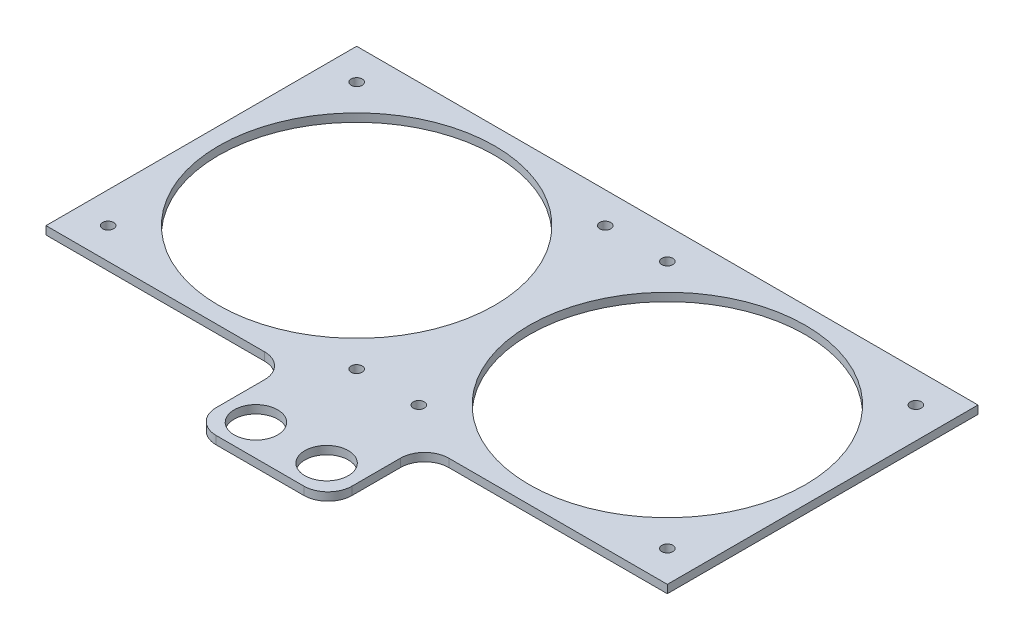
ISO-10303-21;
HEADER;
FILE_DESCRIPTION(('STEP AP214'),'2;1');
FILE_NAME('part.step','',(''),(''),'','','');
FILE_SCHEMA(('AUTOMOTIVE_DESIGN { 1 0 10303 214 1 1 1 1 }'));
ENDSEC;
DATA;
#1=APPLICATION_CONTEXT('core data for automotive mechanical design processes');
#2=APPLICATION_PROTOCOL_DEFINITION('international standard','automotive_design',2000,#1);
#3=PRODUCT_CONTEXT('',#1,'mechanical');
#4=PRODUCT('Part','Part','',(#3));
#5=PRODUCT_RELATED_PRODUCT_CATEGORY('part','',(#4));
#6=PRODUCT_DEFINITION_FORMATION('','',#4);
#7=PRODUCT_DEFINITION_CONTEXT('part definition',#1,'design');
#8=PRODUCT_DEFINITION('design','',#6,#7);
#9=PRODUCT_DEFINITION_SHAPE('','',#8);
#10=(LENGTH_UNIT() NAMED_UNIT(*) SI_UNIT(.MILLI.,.METRE.));
#11=(NAMED_UNIT(*) PLANE_ANGLE_UNIT() SI_UNIT($,.RADIAN.));
#12=(NAMED_UNIT(*) SI_UNIT($,.STERADIAN.) SOLID_ANGLE_UNIT());
#13=UNCERTAINTY_MEASURE_WITH_UNIT(LENGTH_MEASURE(1.E-05),#10,'distance_accuracy_value','');
#14=(GEOMETRIC_REPRESENTATION_CONTEXT(3) GLOBAL_UNCERTAINTY_ASSIGNED_CONTEXT((#13)) GLOBAL_UNIT_ASSIGNED_CONTEXT((#10,
#11,#12)) REPRESENTATION_CONTEXT('',''));
#15=CARTESIAN_POINT('',(0.,0.,0.));
#16=DIRECTION('',(0.,0.,1.));
#17=DIRECTION('',(1.,0.,0.));
#18=AXIS2_PLACEMENT_3D('',#15,#16,#17);
#19=CARTESIAN_POINT('',(0.,3.,0.));
#20=DIRECTION('',(0.,0.,-1.));
#21=DIRECTION('',(-1.,0.,0.));
#22=AXIS2_PLACEMENT_3D('',#19,#20,#21);
#23=PLANE('',#22);
#24=DIRECTION('',(1.,0.,0.));
#25=VECTOR('',#24,1.);
#26=CARTESIAN_POINT('',(0.,3.,0.));
#27=LINE('',#26,#25);
#28=CARTESIAN_POINT('',(148.19,3.,0.));
#29=VERTEX_POINT('',#28);
#30=CARTESIAN_POINT('',(228.6,3.,0.));
#31=VERTEX_POINT('',#30);
#32=EDGE_CURVE('E156',#29,#31,#27,.T.);
#33=ORIENTED_EDGE('',*,*,#32,.F.);
#34=DIRECTION('',(0.,1.,0.));
#35=VECTOR('',#34,1.);
#36=CARTESIAN_POINT('',(148.19,0.,0.));
#37=LINE('',#36,#35);
#38=CARTESIAN_POINT('',(148.19,0.,0.));
#39=VERTEX_POINT('',#38);
#40=EDGE_CURVE('E264',#29,#39,#37,.F.);
#41=ORIENTED_EDGE('',*,*,#40,.T.);
#42=DIRECTION('',(1.,0.,0.));
#43=VECTOR('',#42,1.);
#44=CARTESIAN_POINT('',(0.,0.,0.));
#45=LINE('',#44,#43);
#46=CARTESIAN_POINT('',(228.6,0.,0.));
#47=VERTEX_POINT('',#46);
#48=EDGE_CURVE('E219',#39,#47,#45,.T.);
#49=ORIENTED_EDGE('',*,*,#48,.T.);
#50=DIRECTION('',(0.,-1.,0.));
#51=VECTOR('',#50,1.);
#52=CARTESIAN_POINT('',(228.6,3.,0.));
#53=LINE('',#52,#51);
#54=EDGE_CURVE('E150',#31,#47,#53,.T.);
#55=ORIENTED_EDGE('',*,*,#54,.F.);
#56=EDGE_LOOP('',(#33,#41,#49,#55));
#57=FACE_BOUND('',#56,.T.);
#58=ADVANCED_FACE('F39',(#57),#23,.F.);
#59=CARTESIAN_POINT('',(0.,0.,0.));
#60=VERTEX_POINT('',#59);
#61=CARTESIAN_POINT('',(80.41,0.,0.));
#62=VERTEX_POINT('',#61);
#63=EDGE_CURVE('E220',#60,#62,#45,.T.);
#64=ORIENTED_EDGE('',*,*,#63,.T.);
#65=DIRECTION('',(0.,-1.,0.));
#66=VECTOR('',#65,1.);
#67=CARTESIAN_POINT('',(80.41,3.,0.));
#68=LINE('',#67,#66);
#69=CARTESIAN_POINT('',(80.41,3.,0.));
#70=VERTEX_POINT('',#69);
#71=EDGE_CURVE('E267',#62,#70,#68,.F.);
#72=ORIENTED_EDGE('',*,*,#71,.T.);
#73=CARTESIAN_POINT('',(0.,3.,0.));
#74=VERTEX_POINT('',#73);
#75=EDGE_CURVE('E139',#74,#70,#27,.T.);
#76=ORIENTED_EDGE('',*,*,#75,.F.);
#77=DIRECTION('',(0.,-1.,0.));
#78=VECTOR('',#77,1.);
#79=CARTESIAN_POINT('',(0.,3.,0.));
#80=LINE('',#79,#78);
#81=EDGE_CURVE('E227',#74,#60,#80,.T.);
#82=ORIENTED_EDGE('',*,*,#81,.T.);
#83=EDGE_LOOP('',(#64,#72,#76,#82));
#84=FACE_BOUND('',#83,.T.);
#85=ADVANCED_FACE('F365',(#84),#23,.F.);
#86=CARTESIAN_POINT('',(0.,3.,0.));
#87=DIRECTION('',(0.,-1.,0.));
#88=DIRECTION('',(0.,0.,-1.));
#89=AXIS2_PLACEMENT_3D('',#86,#87,#88);
#90=PLANE('',#89);
#91=CARTESIAN_POINT('',(101.3,3.,24.06));
#92=DIRECTION('',(0.,1.,0.));
#93=DIRECTION('',(0.,0.,1.));
#94=AXIS2_PLACEMENT_3D('',#91,#92,#93);
#95=CIRCLE('',#94,8.);
#96=CARTESIAN_POINT('',(101.3,3.,32.06));
#97=VERTEX_POINT('',#96);
#98=EDGE_CURVE('E418',#97,#97,#95,.T.);
#99=ORIENTED_EDGE('',*,*,#98,.F.);
#100=EDGE_LOOP('',(#99));
#101=FACE_BOUND('',#100,.T.);
#102=CARTESIAN_POINT('',(127.3,3.,24.06));
#103=DIRECTION('',(0.,1.,0.));
#104=DIRECTION('',(0.,0.,1.));
#105=AXIS2_PLACEMENT_3D('',#102,#103,#104);
#106=CIRCLE('',#105,8.00000000000001);
#107=CARTESIAN_POINT('',(127.3,3.,32.06));
#108=VERTEX_POINT('',#107);
#109=EDGE_CURVE('E410',#108,#108,#106,.T.);
#110=ORIENTED_EDGE('',*,*,#109,.F.);
#111=EDGE_LOOP('',(#110));
#112=FACE_BOUND('',#111,.T.);
#113=DIRECTION('',(-1.,0.,0.));
#114=VECTOR('',#113,1.);
#115=CARTESIAN_POINT('',(89.3,3.,35.56));
#116=LINE('',#115,#114);
#117=CARTESIAN_POINT('',(130.41,3.,35.56));
#118=VERTEX_POINT('',#117);
#119=CARTESIAN_POINT('',(98.19,3.,35.56));
#120=VERTEX_POINT('',#119);
#121=EDGE_CURVE('E405',#118,#120,#116,.T.);
#122=ORIENTED_EDGE('',*,*,#121,.F.);
#123=CARTESIAN_POINT('',(130.41,3.,26.67));
#124=DIRECTION('',(0.,-1.,0.));
#125=DIRECTION('',(0.,0.,-1.));
#126=AXIS2_PLACEMENT_3D('',#123,#124,#125);
#127=CIRCLE('',#126,8.89);
#128=CARTESIAN_POINT('',(139.3,3.,26.67));
#129=VERTEX_POINT('',#128);
#130=EDGE_CURVE('E242',#118,#129,#127,.F.);
#131=ORIENTED_EDGE('',*,*,#130,.T.);
#132=DIRECTION('',(0.,0.,-1.));
#133=VECTOR('',#132,1.);
#134=CARTESIAN_POINT('',(139.3,3.,35.56));
#135=LINE('',#134,#133);
#136=CARTESIAN_POINT('',(139.3,3.,8.89));
#137=VERTEX_POINT('',#136);
#138=EDGE_CURVE('E305',#129,#137,#135,.T.);
#139=ORIENTED_EDGE('',*,*,#138,.T.);
#140=CARTESIAN_POINT('',(148.19,3.,8.89));
#141=DIRECTION('',(0.,-1.,0.));
#142=DIRECTION('',(0.,0.,-1.));
#143=AXIS2_PLACEMENT_3D('',#140,#141,#142);
#144=CIRCLE('',#143,8.89);
#145=EDGE_CURVE('E270',#137,#29,#144,.T.);
#146=ORIENTED_EDGE('',*,*,#145,.T.);
#147=ORIENTED_EDGE('',*,*,#32,.T.);
#148=DIRECTION('',(0.,0.,1.));
#149=VECTOR('',#148,1.);
#150=CARTESIAN_POINT('',(228.6,3.,0.));
#151=LINE('',#150,#149);
#152=CARTESIAN_POINT('',(228.6,3.,-114.3));
#153=VERTEX_POINT('',#152);
#154=EDGE_CURVE('E145',#153,#31,#151,.T.);
#155=ORIENTED_EDGE('',*,*,#154,.F.);
#156=DIRECTION('',(-1.,0.,0.));
#157=VECTOR('',#156,1.);
#158=CARTESIAN_POINT('',(0.,3.,-114.3));
#159=LINE('',#158,#157);
#160=CARTESIAN_POINT('',(0.,3.,-114.3));
#161=VERTEX_POINT('',#160);
#162=EDGE_CURVE('E127',#153,#161,#159,.T.);
#163=ORIENTED_EDGE('',*,*,#162,.T.);
#164=DIRECTION('',(0.,0.,1.));
#165=VECTOR('',#164,1.);
#166=CARTESIAN_POINT('',(0.,3.,0.));
#167=LINE('',#166,#165);
#168=EDGE_CURVE('E209',#161,#74,#167,.T.);
#169=ORIENTED_EDGE('',*,*,#168,.T.);
#170=ORIENTED_EDGE('',*,*,#75,.T.);
#171=CARTESIAN_POINT('',(80.41,3.,8.89));
#172=DIRECTION('',(0.,-1.,0.));
#173=DIRECTION('',(0.,0.,-1.));
#174=AXIS2_PLACEMENT_3D('',#171,#172,#173);
#175=CIRCLE('',#174,8.89);
#176=CARTESIAN_POINT('',(89.3,3.,8.89));
#177=VERTEX_POINT('',#176);
#178=EDGE_CURVE('E11',#70,#177,#175,.T.);
#179=ORIENTED_EDGE('',*,*,#178,.T.);
#180=DIRECTION('',(0.,0.,-1.));
#181=VECTOR('',#180,1.);
#182=CARTESIAN_POINT('',(89.3,3.,35.56));
#183=LINE('',#182,#181);
#184=CARTESIAN_POINT('',(89.3,3.,26.67));
#185=VERTEX_POINT('',#184);
#186=EDGE_CURVE('E298',#185,#177,#183,.T.);
#187=ORIENTED_EDGE('',*,*,#186,.F.);
#188=CARTESIAN_POINT('',(98.19,3.,26.67));
#189=DIRECTION('',(0.,-1.,0.));
#190=DIRECTION('',(0.,0.,-1.));
#191=AXIS2_PLACEMENT_3D('',#188,#189,#190);
#192=CIRCLE('',#191,8.89);
#193=EDGE_CURVE('E239',#185,#120,#192,.F.);
#194=ORIENTED_EDGE('',*,*,#193,.T.);
#195=EDGE_LOOP('',(#122,#131,#139,#146,#147,#155,#163,#169,#170,#179,#187,#194));
#196=FACE_BOUND('',#195,.T.);
#197=CARTESIAN_POINT('',(57.15,3.,-57.15));
#198=DIRECTION('',(0.,1.,0.));
#199=DIRECTION('',(0.,0.,1.));
#200=AXIS2_PLACEMENT_3D('',#197,#198,#199);
#201=CIRCLE('',#200,50.8);
#202=CARTESIAN_POINT('',(57.15,3.,-6.35));
#203=VERTEX_POINT('',#202);
#204=EDGE_CURVE('E201',#203,#203,#201,.T.);
#205=ORIENTED_EDGE('',*,*,#204,.F.);
#206=EDGE_LOOP('',(#205));
#207=FACE_BOUND('',#206,.T.);
#208=CARTESIAN_POINT('',(11.43,3.,-102.87));
#209=DIRECTION('',(0.,1.,0.));
#210=DIRECTION('',(0.,0.,1.));
#211=AXIS2_PLACEMENT_3D('',#208,#209,#210);
#212=CIRCLE('',#211,2.032);
#213=CARTESIAN_POINT('',(11.43,3.,-100.838));
#214=VERTEX_POINT('',#213);
#215=EDGE_CURVE('E193',#214,#214,#212,.T.);
#216=ORIENTED_EDGE('',*,*,#215,.F.);
#217=EDGE_LOOP('',(#216));
#218=FACE_BOUND('',#217,.T.);
#219=CARTESIAN_POINT('',(102.87,3.,-102.87));
#220=DIRECTION('',(0.,1.,0.));
#221=DIRECTION('',(0.,0.,1.));
#222=AXIS2_PLACEMENT_3D('',#219,#220,#221);
#223=CIRCLE('',#222,2.03200000000001);
#224=CARTESIAN_POINT('',(102.87,3.,-100.838));
#225=VERTEX_POINT('',#224);
#226=EDGE_CURVE('E185',#225,#225,#223,.T.);
#227=ORIENTED_EDGE('',*,*,#226,.F.);
#228=EDGE_LOOP('',(#227));
#229=FACE_BOUND('',#228,.T.);
#230=CARTESIAN_POINT('',(102.87,3.,-11.43));
#231=DIRECTION('',(0.,1.,0.));
#232=DIRECTION('',(0.,0.,1.));
#233=AXIS2_PLACEMENT_3D('',#230,#231,#232);
#234=CIRCLE('',#233,2.03200000000001);
#235=CARTESIAN_POINT('',(102.87,3.,-9.39799999999998));
#236=VERTEX_POINT('',#235);
#237=EDGE_CURVE('E177',#236,#236,#234,.T.);
#238=ORIENTED_EDGE('',*,*,#237,.F.);
#239=EDGE_LOOP('',(#238));
#240=FACE_BOUND('',#239,.T.);
#241=CARTESIAN_POINT('',(11.43,3.,-11.43));
#242=DIRECTION('',(0.,1.,0.));
#243=DIRECTION('',(0.,0.,1.));
#244=AXIS2_PLACEMENT_3D('',#241,#242,#243);
#245=CIRCLE('',#244,2.032);
#246=CARTESIAN_POINT('',(11.43,3.,-9.39799999999999));
#247=VERTEX_POINT('',#246);
#248=EDGE_CURVE('E169',#247,#247,#245,.T.);
#249=ORIENTED_EDGE('',*,*,#248,.F.);
#250=EDGE_LOOP('',(#249));
#251=FACE_BOUND('',#250,.T.);
#252=CARTESIAN_POINT('',(217.17,3.,-11.43));
#253=DIRECTION('',(0.,-1.,0.));
#254=DIRECTION('',(0.,0.,1.));
#255=AXIS2_PLACEMENT_3D('',#252,#253,#254);
#256=CIRCLE('',#255,2.032);
#257=CARTESIAN_POINT('',(217.17,3.,-9.39799999999999));
#258=VERTEX_POINT('',#257);
#259=EDGE_CURVE('E316',#258,#258,#256,.T.);
#260=ORIENTED_EDGE('',*,*,#259,.T.);
#261=EDGE_LOOP('',(#260));
#262=FACE_BOUND('',#261,.T.);
#263=CARTESIAN_POINT('',(125.73,3.,-11.43));
#264=DIRECTION('',(0.,-1.,0.));
#265=DIRECTION('',(0.,0.,1.));
#266=AXIS2_PLACEMENT_3D('',#263,#264,#265);
#267=CIRCLE('',#266,2.03200000000001);
#268=CARTESIAN_POINT('',(125.73,3.,-9.39799999999998));
#269=VERTEX_POINT('',#268);
#270=EDGE_CURVE('E324',#269,#269,#267,.T.);
#271=ORIENTED_EDGE('',*,*,#270,.T.);
#272=EDGE_LOOP('',(#271));
#273=FACE_BOUND('',#272,.T.);
#274=CARTESIAN_POINT('',(125.73,3.,-102.87));
#275=DIRECTION('',(0.,-1.,0.));
#276=DIRECTION('',(0.,0.,1.));
#277=AXIS2_PLACEMENT_3D('',#274,#275,#276);
#278=CIRCLE('',#277,2.03200000000001);
#279=CARTESIAN_POINT('',(125.73,3.,-100.838));
#280=VERTEX_POINT('',#279);
#281=EDGE_CURVE('E332',#280,#280,#278,.T.);
#282=ORIENTED_EDGE('',*,*,#281,.T.);
#283=EDGE_LOOP('',(#282));
#284=FACE_BOUND('',#283,.T.);
#285=CARTESIAN_POINT('',(217.17,3.,-102.87));
#286=DIRECTION('',(0.,-1.,0.));
#287=DIRECTION('',(0.,0.,1.));
#288=AXIS2_PLACEMENT_3D('',#285,#286,#287);
#289=CIRCLE('',#288,2.032);
#290=CARTESIAN_POINT('',(217.17,3.,-100.838));
#291=VERTEX_POINT('',#290);
#292=EDGE_CURVE('E340',#291,#291,#289,.T.);
#293=ORIENTED_EDGE('',*,*,#292,.T.);
#294=EDGE_LOOP('',(#293));
#295=FACE_BOUND('',#294,.T.);
#296=CARTESIAN_POINT('',(171.45,3.,-57.15));
#297=DIRECTION('',(0.,-1.,0.));
#298=DIRECTION('',(0.,0.,1.));
#299=AXIS2_PLACEMENT_3D('',#296,#297,#298);
#300=CIRCLE('',#299,50.8);
#301=CARTESIAN_POINT('',(171.45,3.,-6.35));
#302=VERTEX_POINT('',#301);
#303=EDGE_CURVE('E163',#302,#302,#300,.T.);
#304=ORIENTED_EDGE('',*,*,#303,.T.);
#305=EDGE_LOOP('',(#304));
#306=FACE_BOUND('',#305,.T.);
#307=ADVANCED_FACE('F153',(#101,#112,#196,#207,#218,#229,#240,#251,#262,#273,#284,#295,#306),
#90,.F.);
#308=CARTESIAN_POINT('',(0.,0.,0.));
#309=DIRECTION('',(0.,-1.,0.));
#310=DIRECTION('',(0.,0.,-1.));
#311=AXIS2_PLACEMENT_3D('',#308,#309,#310);
#312=PLANE('',#311);
#313=CARTESIAN_POINT('',(101.3,0.,24.06));
#314=DIRECTION('',(0.,1.,0.));
#315=DIRECTION('',(0.,0.,1.));
#316=AXIS2_PLACEMENT_3D('',#313,#314,#315);
#317=CIRCLE('',#316,8.);
#318=CARTESIAN_POINT('',(101.3,0.,32.06));
#319=VERTEX_POINT('',#318);
#320=EDGE_CURVE('E407',#319,#319,#317,.T.);
#321=ORIENTED_EDGE('',*,*,#320,.T.);
#322=EDGE_LOOP('',(#321));
#323=FACE_BOUND('',#322,.T.);
#324=CARTESIAN_POINT('',(127.3,0.,24.06));
#325=DIRECTION('',(0.,1.,0.));
#326=DIRECTION('',(0.,0.,1.));
#327=AXIS2_PLACEMENT_3D('',#324,#325,#326);
#328=CIRCLE('',#327,8.00000000000001);
#329=CARTESIAN_POINT('',(127.3,0.,32.06));
#330=VERTEX_POINT('',#329);
#331=EDGE_CURVE('E414',#330,#330,#328,.T.);
#332=ORIENTED_EDGE('',*,*,#331,.T.);
#333=EDGE_LOOP('',(#332));
#334=FACE_BOUND('',#333,.T.);
#335=CARTESIAN_POINT('',(102.87,0.,-11.43));
#336=DIRECTION('',(0.,1.,0.));
#337=DIRECTION('',(0.,0.,1.));
#338=AXIS2_PLACEMENT_3D('',#335,#336,#337);
#339=CIRCLE('',#338,2.03200000000001);
#340=CARTESIAN_POINT('',(102.87,0.,-9.39799999999998));
#341=VERTEX_POINT('',#340);
#342=EDGE_CURVE('E173',#341,#341,#339,.T.);
#343=ORIENTED_EDGE('',*,*,#342,.T.);
#344=EDGE_LOOP('',(#343));
#345=FACE_BOUND('',#344,.T.);
#346=CARTESIAN_POINT('',(11.43,0.,-102.87));
#347=DIRECTION('',(0.,1.,0.));
#348=DIRECTION('',(0.,0.,1.));
#349=AXIS2_PLACEMENT_3D('',#346,#347,#348);
#350=CIRCLE('',#349,2.032);
#351=CARTESIAN_POINT('',(11.43,0.,-100.838));
#352=VERTEX_POINT('',#351);
#353=EDGE_CURVE('E189',#352,#352,#350,.T.);
#354=ORIENTED_EDGE('',*,*,#353,.T.);
#355=EDGE_LOOP('',(#354));
#356=FACE_BOUND('',#355,.T.);
#357=DIRECTION('',(0.,0.,-1.));
#358=VECTOR('',#357,1.);
#359=CARTESIAN_POINT('',(139.3,0.,35.56));
#360=LINE('',#359,#358);
#361=CARTESIAN_POINT('',(139.3,0.,26.67));
#362=VERTEX_POINT('',#361);
#363=CARTESIAN_POINT('',(139.3,0.,8.89));
#364=VERTEX_POINT('',#363);
#365=EDGE_CURVE('E301',#362,#364,#360,.T.);
#366=ORIENTED_EDGE('',*,*,#365,.F.);
#367=CARTESIAN_POINT('',(130.41,0.,26.67));
#368=DIRECTION('',(0.,-1.,0.));
#369=DIRECTION('',(0.,0.,-1.));
#370=AXIS2_PLACEMENT_3D('',#367,#368,#369);
#371=CIRCLE('',#370,8.89);
#372=CARTESIAN_POINT('',(130.41,0.,35.56));
#373=VERTEX_POINT('',#372);
#374=EDGE_CURVE('E255',#362,#373,#371,.T.);
#375=ORIENTED_EDGE('',*,*,#374,.T.);
#376=DIRECTION('',(1.,0.,0.));
#377=VECTOR('',#376,1.);
#378=CARTESIAN_POINT('',(89.3,0.,35.56));
#379=LINE('',#378,#377);
#380=CARTESIAN_POINT('',(98.19,0.,35.56));
#381=VERTEX_POINT('',#380);
#382=EDGE_CURVE('E308',#381,#373,#379,.T.);
#383=ORIENTED_EDGE('',*,*,#382,.F.);
#384=CARTESIAN_POINT('',(98.19,0.,26.67));
#385=DIRECTION('',(0.,-1.,0.));
#386=DIRECTION('',(0.,0.,-1.));
#387=AXIS2_PLACEMENT_3D('',#384,#385,#386);
#388=CIRCLE('',#387,8.89);
#389=CARTESIAN_POINT('',(89.3,0.,26.67));
#390=VERTEX_POINT('',#389);
#391=EDGE_CURVE('E252',#381,#390,#388,.T.);
#392=ORIENTED_EDGE('',*,*,#391,.T.);
#393=DIRECTION('',(0.,0.,-1.));
#394=VECTOR('',#393,1.);
#395=CARTESIAN_POINT('',(89.3,0.,35.56));
#396=LINE('',#395,#394);
#397=CARTESIAN_POINT('',(89.3,0.,8.89));
#398=VERTEX_POINT('',#397);
#399=EDGE_CURVE('E296',#390,#398,#396,.T.);
#400=ORIENTED_EDGE('',*,*,#399,.T.);
#401=CARTESIAN_POINT('',(80.41,0.,8.89));
#402=DIRECTION('',(0.,-1.,0.));
#403=DIRECTION('',(0.,0.,-1.));
#404=AXIS2_PLACEMENT_3D('',#401,#402,#403);
#405=CIRCLE('',#404,8.89);
#406=EDGE_CURVE('E48',#398,#62,#405,.F.);
#407=ORIENTED_EDGE('',*,*,#406,.T.);
#408=ORIENTED_EDGE('',*,*,#63,.F.);
#409=DIRECTION('',(0.,0.,1.));
#410=VECTOR('',#409,1.);
#411=CARTESIAN_POINT('',(0.,0.,0.));
#412=LINE('',#411,#410);
#413=CARTESIAN_POINT('',(0.,0.,-114.3));
#414=VERTEX_POINT('',#413);
#415=EDGE_CURVE('E205',#414,#60,#412,.T.);
#416=ORIENTED_EDGE('',*,*,#415,.F.);
#417=DIRECTION('',(-1.,0.,0.));
#418=VECTOR('',#417,1.);
#419=CARTESIAN_POINT('',(0.,0.,-114.3));
#420=LINE('',#419,#418);
#421=CARTESIAN_POINT('',(228.6,0.,-114.3));
#422=VERTEX_POINT('',#421);
#423=EDGE_CURVE('E212',#422,#414,#420,.T.);
#424=ORIENTED_EDGE('',*,*,#423,.F.);
#425=DIRECTION('',(0.,0.,1.));
#426=VECTOR('',#425,1.);
#427=CARTESIAN_POINT('',(228.6,0.,0.));
#428=LINE('',#427,#426);
#429=EDGE_CURVE('E147',#422,#47,#428,.T.);
#430=ORIENTED_EDGE('',*,*,#429,.T.);
#431=ORIENTED_EDGE('',*,*,#48,.F.);
#432=CARTESIAN_POINT('',(148.19,0.,8.89));
#433=DIRECTION('',(0.,-1.,0.));
#434=DIRECTION('',(0.,0.,-1.));
#435=AXIS2_PLACEMENT_3D('',#432,#433,#434);
#436=CIRCLE('',#435,8.89);
#437=EDGE_CURVE('E273',#39,#364,#436,.F.);
#438=ORIENTED_EDGE('',*,*,#437,.T.);
#439=EDGE_LOOP('',(#366,#375,#383,#392,#400,#407,#408,#416,#424,#430,#431,#438));
#440=FACE_BOUND('',#439,.T.);
#441=CARTESIAN_POINT('',(57.15,0.,-57.15));
#442=DIRECTION('',(0.,1.,0.));
#443=DIRECTION('',(0.,0.,1.));
#444=AXIS2_PLACEMENT_3D('',#441,#442,#443);
#445=CIRCLE('',#444,50.8);
#446=CARTESIAN_POINT('',(57.15,0.,-6.35));
#447=VERTEX_POINT('',#446);
#448=EDGE_CURVE('E197',#447,#447,#445,.T.);
#449=ORIENTED_EDGE('',*,*,#448,.T.);
#450=EDGE_LOOP('',(#449));
#451=FACE_BOUND('',#450,.T.);
#452=CARTESIAN_POINT('',(102.87,0.,-102.87));
#453=DIRECTION('',(0.,1.,0.));
#454=DIRECTION('',(0.,0.,1.));
#455=AXIS2_PLACEMENT_3D('',#452,#453,#454);
#456=CIRCLE('',#455,2.03200000000001);
#457=CARTESIAN_POINT('',(102.87,0.,-100.838));
#458=VERTEX_POINT('',#457);
#459=EDGE_CURVE('E181',#458,#458,#456,.T.);
#460=ORIENTED_EDGE('',*,*,#459,.T.);
#461=EDGE_LOOP('',(#460));
#462=FACE_BOUND('',#461,.T.);
#463=CARTESIAN_POINT('',(11.43,0.,-11.43));
#464=DIRECTION('',(0.,1.,0.));
#465=DIRECTION('',(0.,0.,1.));
#466=AXIS2_PLACEMENT_3D('',#463,#464,#465);
#467=CIRCLE('',#466,2.032);
#468=CARTESIAN_POINT('',(11.43,0.,-9.39799999999999));
#469=VERTEX_POINT('',#468);
#470=EDGE_CURVE('E149',#469,#469,#467,.T.);
#471=ORIENTED_EDGE('',*,*,#470,.T.);
#472=EDGE_LOOP('',(#471));
#473=FACE_BOUND('',#472,.T.);
#474=CARTESIAN_POINT('',(217.17,0.,-11.43));
#475=DIRECTION('',(0.,-1.,0.));
#476=DIRECTION('',(0.,0.,1.));
#477=AXIS2_PLACEMENT_3D('',#474,#475,#476);
#478=CIRCLE('',#477,2.032);
#479=CARTESIAN_POINT('',(217.17,0.,-9.39799999999999));
#480=VERTEX_POINT('',#479);
#481=EDGE_CURVE('E315',#480,#480,#478,.T.);
#482=ORIENTED_EDGE('',*,*,#481,.F.);
#483=EDGE_LOOP('',(#482));
#484=FACE_BOUND('',#483,.T.);
#485=CARTESIAN_POINT('',(125.73,0.,-11.43));
#486=DIRECTION('',(0.,-1.,0.));
#487=DIRECTION('',(0.,0.,1.));
#488=AXIS2_PLACEMENT_3D('',#485,#486,#487);
#489=CIRCLE('',#488,2.03200000000001);
#490=CARTESIAN_POINT('',(125.73,0.,-9.39799999999998));
#491=VERTEX_POINT('',#490);
#492=EDGE_CURVE('E320',#491,#491,#489,.T.);
#493=ORIENTED_EDGE('',*,*,#492,.F.);
#494=EDGE_LOOP('',(#493));
#495=FACE_BOUND('',#494,.T.);
#496=CARTESIAN_POINT('',(125.73,0.,-102.87));
#497=DIRECTION('',(0.,-1.,0.));
#498=DIRECTION('',(0.,0.,1.));
#499=AXIS2_PLACEMENT_3D('',#496,#497,#498);
#500=CIRCLE('',#499,2.03200000000001);
#501=CARTESIAN_POINT('',(125.73,0.,-100.838));
#502=VERTEX_POINT('',#501);
#503=EDGE_CURVE('E328',#502,#502,#500,.T.);
#504=ORIENTED_EDGE('',*,*,#503,.F.);
#505=EDGE_LOOP('',(#504));
#506=FACE_BOUND('',#505,.T.);
#507=CARTESIAN_POINT('',(217.17,0.,-102.87));
#508=DIRECTION('',(0.,-1.,0.));
#509=DIRECTION('',(0.,0.,1.));
#510=AXIS2_PLACEMENT_3D('',#507,#508,#509);
#511=CIRCLE('',#510,2.032);
#512=CARTESIAN_POINT('',(217.17,0.,-100.838));
#513=VERTEX_POINT('',#512);
#514=EDGE_CURVE('E336',#513,#513,#511,.T.);
#515=ORIENTED_EDGE('',*,*,#514,.F.);
#516=EDGE_LOOP('',(#515));
#517=FACE_BOUND('',#516,.T.);
#518=CARTESIAN_POINT('',(171.45,0.,-57.15));
#519=DIRECTION('',(0.,-1.,0.));
#520=DIRECTION('',(0.,0.,1.));
#521=AXIS2_PLACEMENT_3D('',#518,#519,#520);
#522=CIRCLE('',#521,50.8);
#523=CARTESIAN_POINT('',(171.45,0.,-6.35));
#524=VERTEX_POINT('',#523);
#525=EDGE_CURVE('E166',#524,#524,#522,.T.);
#526=ORIENTED_EDGE('',*,*,#525,.F.);
#527=EDGE_LOOP('',(#526));
#528=FACE_BOUND('',#527,.T.);
#529=ADVANCED_FACE('F283',(#323,#334,#345,#356,#440,#451,#462,#473,#484,#495,#506,#517,#528),
#312,.T.);
#530=CARTESIAN_POINT('',(0.,3.,0.));
#531=DIRECTION('',(1.,0.,0.));
#532=DIRECTION('',(0.,0.,-1.));
#533=AXIS2_PLACEMENT_3D('',#530,#531,#532);
#534=PLANE('',#533);
#535=ORIENTED_EDGE('',*,*,#415,.T.);
#536=ORIENTED_EDGE('',*,*,#81,.F.);
#537=ORIENTED_EDGE('',*,*,#168,.F.);
#538=DIRECTION('',(0.,-1.,0.));
#539=VECTOR('',#538,1.);
#540=CARTESIAN_POINT('',(0.,3.,-114.3));
#541=LINE('',#540,#539);
#542=EDGE_CURVE('E133',#161,#414,#541,.T.);
#543=ORIENTED_EDGE('',*,*,#542,.T.);
#544=EDGE_LOOP('',(#535,#536,#537,#543));
#545=FACE_BOUND('',#544,.T.);
#546=ADVANCED_FACE('F287',(#545),#534,.F.);
#547=CARTESIAN_POINT('',(0.,3.,-114.3));
#548=DIRECTION('',(0.,0.,1.));
#549=DIRECTION('',(1.,0.,0.));
#550=AXIS2_PLACEMENT_3D('',#547,#548,#549);
#551=PLANE('',#550);
#552=ORIENTED_EDGE('',*,*,#423,.T.);
#553=ORIENTED_EDGE('',*,*,#542,.F.);
#554=ORIENTED_EDGE('',*,*,#162,.F.);
#555=DIRECTION('',(0.,-1.,0.));
#556=VECTOR('',#555,1.);
#557=CARTESIAN_POINT('',(228.6,3.,-114.3));
#558=LINE('',#557,#556);
#559=EDGE_CURVE('E130',#153,#422,#558,.T.);
#560=ORIENTED_EDGE('',*,*,#559,.T.);
#561=EDGE_LOOP('',(#552,#553,#554,#560));
#562=FACE_BOUND('',#561,.T.);
#563=ADVANCED_FACE('F129',(#562),#551,.F.);
#564=CARTESIAN_POINT('',(57.15,3.,-57.15));
#565=DIRECTION('',(0.,-1.,0.));
#566=DIRECTION('',(0.,0.,-1.));
#567=AXIS2_PLACEMENT_3D('',#564,#565,#566);
#568=CYLINDRICAL_SURFACE('',#567,50.8);
#569=ORIENTED_EDGE('',*,*,#204,.T.);
#570=EDGE_LOOP('',(#569));
#571=FACE_BOUND('',#570,.T.);
#572=ORIENTED_EDGE('',*,*,#448,.F.);
#573=EDGE_LOOP('',(#572));
#574=FACE_BOUND('',#573,.T.);
#575=ADVANCED_FACE('F481',(#571,#574),#568,.F.);
#576=CARTESIAN_POINT('',(11.43,3.,-102.87));
#577=DIRECTION('',(0.,-1.,0.));
#578=DIRECTION('',(0.,0.,-1.));
#579=AXIS2_PLACEMENT_3D('',#576,#577,#578);
#580=CYLINDRICAL_SURFACE('',#579,2.032);
#581=ORIENTED_EDGE('',*,*,#215,.T.);
#582=EDGE_LOOP('',(#581));
#583=FACE_BOUND('',#582,.T.);
#584=ORIENTED_EDGE('',*,*,#353,.F.);
#585=EDGE_LOOP('',(#584));
#586=FACE_BOUND('',#585,.T.);
#587=ADVANCED_FACE('F477',(#583,#586),#580,.F.);
#588=CARTESIAN_POINT('',(102.87,3.,-102.87));
#589=DIRECTION('',(0.,-1.,0.));
#590=DIRECTION('',(0.,0.,-1.));
#591=AXIS2_PLACEMENT_3D('',#588,#589,#590);
#592=CYLINDRICAL_SURFACE('',#591,2.03200000000001);
#593=ORIENTED_EDGE('',*,*,#226,.T.);
#594=EDGE_LOOP('',(#593));
#595=FACE_BOUND('',#594,.T.);
#596=ORIENTED_EDGE('',*,*,#459,.F.);
#597=EDGE_LOOP('',(#596));
#598=FACE_BOUND('',#597,.T.);
#599=ADVANCED_FACE('F473',(#595,#598),#592,.F.);
#600=CARTESIAN_POINT('',(102.87,3.,-11.43));
#601=DIRECTION('',(0.,-1.,0.));
#602=DIRECTION('',(0.,0.,-1.));
#603=AXIS2_PLACEMENT_3D('',#600,#601,#602);
#604=CYLINDRICAL_SURFACE('',#603,2.03200000000001);
#605=ORIENTED_EDGE('',*,*,#237,.T.);
#606=EDGE_LOOP('',(#605));
#607=FACE_BOUND('',#606,.T.);
#608=ORIENTED_EDGE('',*,*,#342,.F.);
#609=EDGE_LOOP('',(#608));
#610=FACE_BOUND('',#609,.T.);
#611=ADVANCED_FACE('F469',(#607,#610),#604,.F.);
#612=CARTESIAN_POINT('',(11.43,3.,-11.43));
#613=DIRECTION('',(0.,-1.,0.));
#614=DIRECTION('',(0.,0.,-1.));
#615=AXIS2_PLACEMENT_3D('',#612,#613,#614);
#616=CYLINDRICAL_SURFACE('',#615,2.032);
#617=ORIENTED_EDGE('',*,*,#248,.T.);
#618=EDGE_LOOP('',(#617));
#619=FACE_BOUND('',#618,.T.);
#620=ORIENTED_EDGE('',*,*,#470,.F.);
#621=EDGE_LOOP('',(#620));
#622=FACE_BOUND('',#621,.T.);
#623=ADVANCED_FACE('F466',(#619,#622),#616,.F.);
#624=CARTESIAN_POINT('',(228.6,3.,0.));
#625=DIRECTION('',(1.,0.,0.));
#626=DIRECTION('',(0.,0.,-1.));
#627=AXIS2_PLACEMENT_3D('',#624,#625,#626);
#628=PLANE('',#627);
#629=ORIENTED_EDGE('',*,*,#429,.F.);
#630=ORIENTED_EDGE('',*,*,#559,.F.);
#631=ORIENTED_EDGE('',*,*,#154,.T.);
#632=ORIENTED_EDGE('',*,*,#54,.T.);
#633=EDGE_LOOP('',(#629,#630,#631,#632));
#634=FACE_BOUND('',#633,.T.);
#635=ADVANCED_FACE('F143',(#634),#628,.T.);
#636=CARTESIAN_POINT('',(171.45,3.,-57.15));
#637=DIRECTION('',(0.,-1.,0.));
#638=DIRECTION('',(0.,0.,-1.));
#639=AXIS2_PLACEMENT_3D('',#636,#637,#638);
#640=CYLINDRICAL_SURFACE('',#639,50.8);
#641=ORIENTED_EDGE('',*,*,#303,.F.);
#642=EDGE_LOOP('',(#641));
#643=FACE_BOUND('',#642,.T.);
#644=ORIENTED_EDGE('',*,*,#525,.T.);
#645=EDGE_LOOP('',(#644));
#646=FACE_BOUND('',#645,.T.);
#647=ADVANCED_FACE('F354',(#643,#646),#640,.F.);
#648=CARTESIAN_POINT('',(217.17,3.,-102.87));
#649=DIRECTION('',(0.,-1.,0.));
#650=DIRECTION('',(0.,0.,-1.));
#651=AXIS2_PLACEMENT_3D('',#648,#649,#650);
#652=CYLINDRICAL_SURFACE('',#651,2.032);
#653=ORIENTED_EDGE('',*,*,#292,.F.);
#654=EDGE_LOOP('',(#653));
#655=FACE_BOUND('',#654,.T.);
#656=ORIENTED_EDGE('',*,*,#514,.T.);
#657=EDGE_LOOP('',(#656));
#658=FACE_BOUND('',#657,.T.);
#659=ADVANCED_FACE('F456',(#655,#658),#652,.F.);
#660=CARTESIAN_POINT('',(125.73,3.,-102.87));
#661=DIRECTION('',(0.,-1.,0.));
#662=DIRECTION('',(0.,0.,-1.));
#663=AXIS2_PLACEMENT_3D('',#660,#661,#662);
#664=CYLINDRICAL_SURFACE('',#663,2.03200000000001);
#665=ORIENTED_EDGE('',*,*,#281,.F.);
#666=EDGE_LOOP('',(#665));
#667=FACE_BOUND('',#666,.T.);
#668=ORIENTED_EDGE('',*,*,#503,.T.);
#669=EDGE_LOOP('',(#668));
#670=FACE_BOUND('',#669,.T.);
#671=ADVANCED_FACE('F452',(#667,#670),#664,.F.);
#672=CARTESIAN_POINT('',(125.73,3.,-11.43));
#673=DIRECTION('',(0.,-1.,0.));
#674=DIRECTION('',(0.,0.,-1.));
#675=AXIS2_PLACEMENT_3D('',#672,#673,#674);
#676=CYLINDRICAL_SURFACE('',#675,2.03200000000001);
#677=ORIENTED_EDGE('',*,*,#270,.F.);
#678=EDGE_LOOP('',(#677));
#679=FACE_BOUND('',#678,.T.);
#680=ORIENTED_EDGE('',*,*,#492,.T.);
#681=EDGE_LOOP('',(#680));
#682=FACE_BOUND('',#681,.T.);
#683=ADVANCED_FACE('F448',(#679,#682),#676,.F.);
#684=CARTESIAN_POINT('',(217.17,3.,-11.43));
#685=DIRECTION('',(0.,-1.,0.));
#686=DIRECTION('',(0.,0.,-1.));
#687=AXIS2_PLACEMENT_3D('',#684,#685,#686);
#688=CYLINDRICAL_SURFACE('',#687,2.032);
#689=ORIENTED_EDGE('',*,*,#259,.F.);
#690=EDGE_LOOP('',(#689));
#691=FACE_BOUND('',#690,.T.);
#692=ORIENTED_EDGE('',*,*,#481,.T.);
#693=EDGE_LOOP('',(#692));
#694=FACE_BOUND('',#693,.T.);
#695=ADVANCED_FACE('F445',(#691,#694),#688,.F.);
#696=CARTESIAN_POINT('',(139.3,3.,35.56));
#697=DIRECTION('',(-1.,0.,0.));
#698=DIRECTION('',(0.,0.,1.));
#699=AXIS2_PLACEMENT_3D('',#696,#697,#698);
#700=PLANE('',#699);
#701=ORIENTED_EDGE('',*,*,#138,.F.);
#702=DIRECTION('',(0.,1.,0.));
#703=VECTOR('',#702,1.);
#704=CARTESIAN_POINT('',(139.3,0.,26.67));
#705=LINE('',#704,#703);
#706=EDGE_CURVE('E249',#129,#362,#705,.F.);
#707=ORIENTED_EDGE('',*,*,#706,.T.);
#708=ORIENTED_EDGE('',*,*,#365,.T.);
#709=DIRECTION('',(0.,1.,0.));
#710=VECTOR('',#709,1.);
#711=CARTESIAN_POINT('',(139.3,3.,8.89));
#712=LINE('',#711,#710);
#713=EDGE_CURVE('E245',#364,#137,#712,.T.);
#714=ORIENTED_EDGE('',*,*,#713,.T.);
#715=EDGE_LOOP('',(#701,#707,#708,#714));
#716=FACE_BOUND('',#715,.T.);
#717=ADVANCED_FACE('F396',(#716),#700,.F.);
#718=CARTESIAN_POINT('',(89.3,3.,35.56));
#719=DIRECTION('',(1.,0.,0.));
#720=DIRECTION('',(0.,0.,-1.));
#721=AXIS2_PLACEMENT_3D('',#718,#719,#720);
#722=PLANE('',#721);
#723=ORIENTED_EDGE('',*,*,#399,.F.);
#724=DIRECTION('',(0.,-1.,0.));
#725=VECTOR('',#724,1.);
#726=CARTESIAN_POINT('',(89.3,3.,26.67));
#727=LINE('',#726,#725);
#728=EDGE_CURVE('E261',#390,#185,#727,.F.);
#729=ORIENTED_EDGE('',*,*,#728,.T.);
#730=ORIENTED_EDGE('',*,*,#186,.T.);
#731=DIRECTION('',(0.,-1.,0.));
#732=VECTOR('',#731,1.);
#733=CARTESIAN_POINT('',(89.3,0.,8.89));
#734=LINE('',#733,#732);
#735=EDGE_CURVE('E258',#177,#398,#734,.T.);
#736=ORIENTED_EDGE('',*,*,#735,.T.);
#737=EDGE_LOOP('',(#723,#729,#730,#736));
#738=FACE_BOUND('',#737,.T.);
#739=ADVANCED_FACE('F295',(#738),#722,.F.);
#740=CARTESIAN_POINT('',(0.,0.,35.56));
#741=DIRECTION('',(0.,0.,1.));
#742=DIRECTION('',(1.,0.,0.));
#743=AXIS2_PLACEMENT_3D('',#740,#741,#742);
#744=PLANE('',#743);
#745=ORIENTED_EDGE('',*,*,#382,.T.);
#746=DIRECTION('',(0.,1.,0.));
#747=VECTOR('',#746,1.);
#748=CARTESIAN_POINT('',(130.41,3.,35.56));
#749=LINE('',#748,#747);
#750=EDGE_CURVE('E235',#373,#118,#749,.T.);
#751=ORIENTED_EDGE('',*,*,#750,.T.);
#752=ORIENTED_EDGE('',*,*,#121,.T.);
#753=DIRECTION('',(0.,-1.,0.));
#754=VECTOR('',#753,1.);
#755=CARTESIAN_POINT('',(98.19,0.,35.56));
#756=LINE('',#755,#754);
#757=EDGE_CURVE('E231',#120,#381,#756,.T.);
#758=ORIENTED_EDGE('',*,*,#757,.T.);
#759=EDGE_LOOP('',(#745,#751,#752,#758));
#760=FACE_BOUND('',#759,.T.);
#761=ADVANCED_FACE('F401',(#760),#744,.T.);
#762=CARTESIAN_POINT('',(127.3,0.,24.06));
#763=DIRECTION('',(0.,1.,0.));
#764=DIRECTION('',(0.,0.,1.));
#765=AXIS2_PLACEMENT_3D('',#762,#763,#764);
#766=CYLINDRICAL_SURFACE('',#765,8.00000000000001);
#767=ORIENTED_EDGE('',*,*,#331,.F.);
#768=EDGE_LOOP('',(#767));
#769=FACE_BOUND('',#768,.T.);
#770=ORIENTED_EDGE('',*,*,#109,.T.);
#771=EDGE_LOOP('',(#770));
#772=FACE_BOUND('',#771,.T.);
#773=ADVANCED_FACE('F427',(#769,#772),#766,.F.);
#774=CARTESIAN_POINT('',(101.3,0.,24.06));
#775=DIRECTION('',(0.,1.,0.));
#776=DIRECTION('',(0.,0.,1.));
#777=AXIS2_PLACEMENT_3D('',#774,#775,#776);
#778=CYLINDRICAL_SURFACE('',#777,8.);
#779=ORIENTED_EDGE('',*,*,#320,.F.);
#780=EDGE_LOOP('',(#779));
#781=FACE_BOUND('',#780,.T.);
#782=ORIENTED_EDGE('',*,*,#98,.T.);
#783=EDGE_LOOP('',(#782));
#784=FACE_BOUND('',#783,.T.);
#785=ADVANCED_FACE('F382',(#781,#784),#778,.F.);
#786=CARTESIAN_POINT('',(130.41,0.,26.67));
#787=DIRECTION('',(0.,-1.,0.));
#788=DIRECTION('',(0.,0.,-1.));
#789=AXIS2_PLACEMENT_3D('',#786,#787,#788);
#790=CYLINDRICAL_SURFACE('',#789,8.89);
#791=ORIENTED_EDGE('',*,*,#374,.F.);
#792=ORIENTED_EDGE('',*,*,#706,.F.);
#793=ORIENTED_EDGE('',*,*,#130,.F.);
#794=ORIENTED_EDGE('',*,*,#750,.F.);
#795=EDGE_LOOP('',(#791,#792,#793,#794));
#796=FACE_BOUND('',#795,.T.);
#797=ADVANCED_FACE('F378',(#796),#790,.T.);
#798=CARTESIAN_POINT('',(98.19,0.,26.67));
#799=DIRECTION('',(0.,1.,0.));
#800=DIRECTION('',(0.,0.,1.));
#801=AXIS2_PLACEMENT_3D('',#798,#799,#800);
#802=CYLINDRICAL_SURFACE('',#801,8.89);
#803=ORIENTED_EDGE('',*,*,#193,.F.);
#804=ORIENTED_EDGE('',*,*,#728,.F.);
#805=ORIENTED_EDGE('',*,*,#391,.F.);
#806=ORIENTED_EDGE('',*,*,#757,.F.);
#807=EDGE_LOOP('',(#803,#804,#805,#806));
#808=FACE_BOUND('',#807,.T.);
#809=ADVANCED_FACE('F381',(#808),#802,.T.);
#810=CARTESIAN_POINT('',(148.19,3.,8.89));
#811=DIRECTION('',(0.,-1.,0.));
#812=DIRECTION('',(0.,0.,-1.));
#813=AXIS2_PLACEMENT_3D('',#810,#811,#812);
#814=CYLINDRICAL_SURFACE('',#813,8.89);
#815=ORIENTED_EDGE('',*,*,#437,.F.);
#816=ORIENTED_EDGE('',*,*,#40,.F.);
#817=ORIENTED_EDGE('',*,*,#145,.F.);
#818=ORIENTED_EDGE('',*,*,#713,.F.);
#819=EDGE_LOOP('',(#815,#816,#817,#818));
#820=FACE_BOUND('',#819,.T.);
#821=ADVANCED_FACE('F385',(#820),#814,.F.);
#822=CARTESIAN_POINT('',(80.41,3.,8.89));
#823=DIRECTION('',(0.,1.,0.));
#824=DIRECTION('',(0.,0.,1.));
#825=AXIS2_PLACEMENT_3D('',#822,#823,#824);
#826=CYLINDRICAL_SURFACE('',#825,8.89);
#827=ORIENTED_EDGE('',*,*,#178,.F.);
#828=ORIENTED_EDGE('',*,*,#71,.F.);
#829=ORIENTED_EDGE('',*,*,#406,.F.);
#830=ORIENTED_EDGE('',*,*,#735,.F.);
#831=EDGE_LOOP('',(#827,#828,#829,#830));
#832=FACE_BOUND('',#831,.T.);
#833=ADVANCED_FACE('F41',(#832),#826,.F.);
#834=CLOSED_SHELL('',(#58,#85,#307,#529,#546,#563,#575,#587,#599,#611,#623,#635,#647,#659,#671,
#683,#695,#717,#739,#761,#773,#785,#797,#809,#821,#833));
#835=MANIFOLD_SOLID_BREP('B2',#834);
#836=ADVANCED_BREP_SHAPE_REPRESENTATION('',(#18,#835),#14);
#837=SHAPE_DEFINITION_REPRESENTATION(#9,#836);
ENDSEC;
END-ISO-10303-21;
